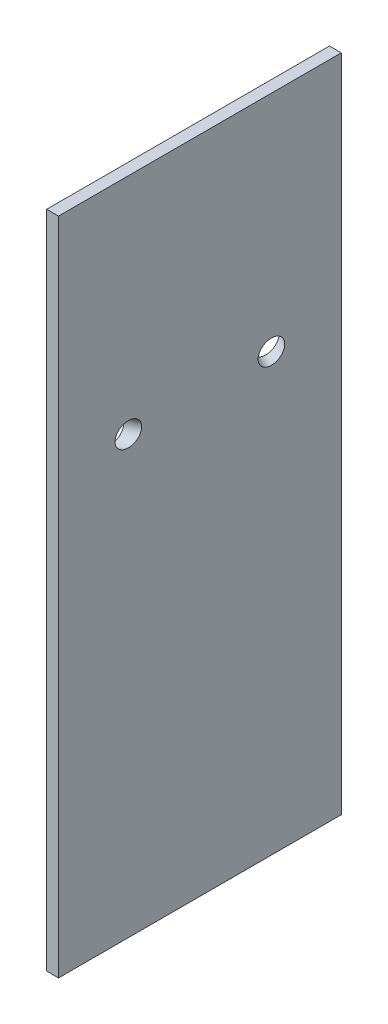
ISO-10303-21;
HEADER;
FILE_DESCRIPTION(('STEP AP214'),'2;1');
FILE_NAME('part.step','',(''),(''),'','','');
FILE_SCHEMA(('AUTOMOTIVE_DESIGN { 1 0 10303 214 1 1 1 1 }'));
ENDSEC;
DATA;
#1=APPLICATION_CONTEXT('core data for automotive mechanical design processes');
#2=APPLICATION_PROTOCOL_DEFINITION('international standard','automotive_design',2000,#1);
#3=PRODUCT_CONTEXT('',#1,'mechanical');
#4=PRODUCT('Part','Part','',(#3));
#5=PRODUCT_RELATED_PRODUCT_CATEGORY('part','',(#4));
#6=PRODUCT_DEFINITION_FORMATION('','',#4);
#7=PRODUCT_DEFINITION_CONTEXT('part definition',#1,'design');
#8=PRODUCT_DEFINITION('design','',#6,#7);
#9=PRODUCT_DEFINITION_SHAPE('','',#8);
#10=(LENGTH_UNIT() NAMED_UNIT(*) SI_UNIT(.MILLI.,.METRE.));
#11=(NAMED_UNIT(*) PLANE_ANGLE_UNIT() SI_UNIT($,.RADIAN.));
#12=(NAMED_UNIT(*) SI_UNIT($,.STERADIAN.) SOLID_ANGLE_UNIT());
#13=UNCERTAINTY_MEASURE_WITH_UNIT(LENGTH_MEASURE(1.E-05),#10,'distance_accuracy_value','');
#14=(GEOMETRIC_REPRESENTATION_CONTEXT(3) GLOBAL_UNCERTAINTY_ASSIGNED_CONTEXT((#13)) GLOBAL_UNIT_ASSIGNED_CONTEXT((#10,
#11,#12)) REPRESENTATION_CONTEXT('',''));
#15=CARTESIAN_POINT('',(0.,0.,0.));
#16=DIRECTION('',(0.,0.,1.));
#17=DIRECTION('',(1.,0.,0.));
#18=AXIS2_PLACEMENT_3D('',#15,#16,#17);
#19=CARTESIAN_POINT('',(6.35,355.6,-152.4));
#20=DIRECTION('',(0.,0.,1.));
#21=DIRECTION('',(0.,-1.,0.));
#22=AXIS2_PLACEMENT_3D('',#19,#20,#21);
#23=PLANE('',#22);
#24=DIRECTION('',(0.,1.,0.));
#25=VECTOR('',#24,1.);
#26=CARTESIAN_POINT('',(-6.35,355.6,-152.4));
#27=LINE('',#26,#25);
#28=CARTESIAN_POINT('',(-6.35,-355.6,-152.4));
#29=VERTEX_POINT('',#28);
#30=CARTESIAN_POINT('',(-6.35,355.6,-152.4));
#31=VERTEX_POINT('',#30);
#32=EDGE_CURVE('E115',#29,#31,#27,.T.);
#33=ORIENTED_EDGE('',*,*,#32,.T.);
#34=DIRECTION('',(-1.,0.,0.));
#35=VECTOR('',#34,1.);
#36=CARTESIAN_POINT('',(6.35,355.6,-152.4));
#37=LINE('',#36,#35);
#38=CARTESIAN_POINT('',(6.35,355.6,-152.4));
#39=VERTEX_POINT('',#38);
#40=EDGE_CURVE('E102',#39,#31,#37,.T.);
#41=ORIENTED_EDGE('',*,*,#40,.F.);
#42=DIRECTION('',(0.,1.,0.));
#43=VECTOR('',#42,1.);
#44=CARTESIAN_POINT('',(6.35,355.6,-152.4));
#45=LINE('',#44,#43);
#46=CARTESIAN_POINT('',(6.35,-355.6,-152.4));
#47=VERTEX_POINT('',#46);
#48=EDGE_CURVE('E121',#47,#39,#45,.T.);
#49=ORIENTED_EDGE('',*,*,#48,.F.);
#50=DIRECTION('',(-1.,0.,0.));
#51=VECTOR('',#50,1.);
#52=CARTESIAN_POINT('',(6.35,-355.6,-152.4));
#53=LINE('',#52,#51);
#54=EDGE_CURVE('E104',#47,#29,#53,.T.);
#55=ORIENTED_EDGE('',*,*,#54,.T.);
#56=EDGE_LOOP('',(#33,#41,#49,#55));
#57=FACE_BOUND('',#56,.T.);
#58=ADVANCED_FACE('F46',(#57),#23,.F.);
#59=CARTESIAN_POINT('',(6.35,355.6,152.4));
#60=DIRECTION('',(0.,-1.,0.));
#61=DIRECTION('',(0.,0.,-1.));
#62=AXIS2_PLACEMENT_3D('',#59,#60,#61);
#63=PLANE('',#62);
#64=DIRECTION('',(0.,0.,1.));
#65=VECTOR('',#64,1.);
#66=CARTESIAN_POINT('',(-6.35,355.6,152.4));
#67=LINE('',#66,#65);
#68=CARTESIAN_POINT('',(-6.35,355.6,152.4));
#69=VERTEX_POINT('',#68);
#70=EDGE_CURVE('E65',#31,#69,#67,.T.);
#71=ORIENTED_EDGE('',*,*,#70,.T.);
#72=DIRECTION('',(-1.,0.,0.));
#73=VECTOR('',#72,1.);
#74=CARTESIAN_POINT('',(6.35,355.6,152.4));
#75=LINE('',#74,#73);
#76=CARTESIAN_POINT('',(6.35,355.6,152.4));
#77=VERTEX_POINT('',#76);
#78=EDGE_CURVE('E99',#77,#69,#75,.T.);
#79=ORIENTED_EDGE('',*,*,#78,.F.);
#80=DIRECTION('',(0.,0.,1.));
#81=VECTOR('',#80,1.);
#82=CARTESIAN_POINT('',(6.35,355.6,152.4));
#83=LINE('',#82,#81);
#84=EDGE_CURVE('E81',#39,#77,#83,.T.);
#85=ORIENTED_EDGE('',*,*,#84,.F.);
#86=ORIENTED_EDGE('',*,*,#40,.T.);
#87=EDGE_LOOP('',(#71,#79,#85,#86));
#88=FACE_BOUND('',#87,.T.);
#89=ADVANCED_FACE('F98',(#88),#63,.F.);
#90=CARTESIAN_POINT('',(6.35,355.6,152.4));
#91=DIRECTION('',(0.,0.,-1.));
#92=DIRECTION('',(0.,1.,0.));
#93=AXIS2_PLACEMENT_3D('',#90,#91,#92);
#94=PLANE('',#93);
#95=DIRECTION('',(0.,-1.,0.));
#96=VECTOR('',#95,1.);
#97=CARTESIAN_POINT('',(-6.35,355.6,152.4));
#98=LINE('',#97,#96);
#99=CARTESIAN_POINT('',(-6.35,-355.6,152.4));
#100=VERTEX_POINT('',#99);
#101=EDGE_CURVE('E96',#69,#100,#98,.T.);
#102=ORIENTED_EDGE('',*,*,#101,.T.);
#103=DIRECTION('',(-1.,0.,0.));
#104=VECTOR('',#103,1.);
#105=CARTESIAN_POINT('',(6.35,-355.6,152.4));
#106=LINE('',#105,#104);
#107=CARTESIAN_POINT('',(6.35,-355.6,152.4));
#108=VERTEX_POINT('',#107);
#109=EDGE_CURVE('E124',#108,#100,#106,.T.);
#110=ORIENTED_EDGE('',*,*,#109,.F.);
#111=DIRECTION('',(0.,-1.,0.));
#112=VECTOR('',#111,1.);
#113=CARTESIAN_POINT('',(6.35,355.6,152.4));
#114=LINE('',#113,#112);
#115=EDGE_CURVE('E107',#77,#108,#114,.T.);
#116=ORIENTED_EDGE('',*,*,#115,.F.);
#117=ORIENTED_EDGE('',*,*,#78,.T.);
#118=EDGE_LOOP('',(#102,#110,#116,#117));
#119=FACE_BOUND('',#118,.T.);
#120=ADVANCED_FACE('F106',(#119),#94,.F.);
#121=CARTESIAN_POINT('',(6.35,-355.6,152.4));
#122=DIRECTION('',(0.,1.,0.));
#123=DIRECTION('',(0.,0.,1.));
#124=AXIS2_PLACEMENT_3D('',#121,#122,#123);
#125=PLANE('',#124);
#126=DIRECTION('',(0.,0.,-1.));
#127=VECTOR('',#126,1.);
#128=CARTESIAN_POINT('',(-6.35,-355.6,152.4));
#129=LINE('',#128,#127);
#130=EDGE_CURVE('E90',#100,#29,#129,.T.);
#131=ORIENTED_EDGE('',*,*,#130,.T.);
#132=ORIENTED_EDGE('',*,*,#54,.F.);
#133=DIRECTION('',(0.,0.,-1.));
#134=VECTOR('',#133,1.);
#135=CARTESIAN_POINT('',(6.35,-355.6,152.4));
#136=LINE('',#135,#134);
#137=EDGE_CURVE('E117',#108,#47,#136,.T.);
#138=ORIENTED_EDGE('',*,*,#137,.F.);
#139=ORIENTED_EDGE('',*,*,#109,.T.);
#140=EDGE_LOOP('',(#131,#132,#138,#139));
#141=FACE_BOUND('',#140,.T.);
#142=ADVANCED_FACE('F132',(#141),#125,.F.);
#143=CARTESIAN_POINT('',(6.35,0.,0.));
#144=DIRECTION('',(1.,0.,0.));
#145=DIRECTION('',(0.,0.,-1.));
#146=AXIS2_PLACEMENT_3D('',#143,#144,#145);
#147=PLANE('',#146);
#148=CARTESIAN_POINT('',(6.34999999999997,114.3,77.0805555555679));
#149=DIRECTION('',(1.,0.,0.));
#150=DIRECTION('',(0.,0.,1.));
#151=AXIS2_PLACEMENT_3D('',#148,#149,#150);
#152=ELLIPSE('',#151,14.360265663917,12.7);
#153=CARTESIAN_POINT('',(6.34999999999997,114.3,91.4408212194849));
#154=VERTEX_POINT('',#153);
#155=EDGE_CURVE('E122',#154,#154,#152,.F.);
#156=ORIENTED_EDGE('',*,*,#155,.T.);
#157=EDGE_LOOP('',(#156));
#158=FACE_BOUND('',#157,.T.);
#159=CARTESIAN_POINT('',(6.34999999999997,114.3,-77.0805555555697));
#160=DIRECTION('',(1.,0.,0.));
#161=DIRECTION('',(0.,0.,1.));
#162=AXIS2_PLACEMENT_3D('',#159,#160,#161);
#163=ELLIPSE('',#162,14.3602656639171,12.7);
#164=CARTESIAN_POINT('',(6.34999999999997,114.3,-62.7202898916527));
#165=VERTEX_POINT('',#164);
#166=EDGE_CURVE('E50',#165,#165,#163,.F.);
#167=ORIENTED_EDGE('',*,*,#166,.T.);
#168=EDGE_LOOP('',(#167));
#169=FACE_BOUND('',#168,.T.);
#170=ORIENTED_EDGE('',*,*,#48,.T.);
#171=ORIENTED_EDGE('',*,*,#84,.T.);
#172=ORIENTED_EDGE('',*,*,#115,.T.);
#173=ORIENTED_EDGE('',*,*,#137,.T.);
#174=EDGE_LOOP('',(#170,#171,#172,#173));
#175=FACE_BOUND('',#174,.T.);
#176=ADVANCED_FACE('F48',(#158,#169,#175),#147,.T.);
#177=CARTESIAN_POINT('',(-6.35,0.,0.));
#178=DIRECTION('',(1.,0.,0.));
#179=DIRECTION('',(0.,0.,-1.));
#180=AXIS2_PLACEMENT_3D('',#177,#178,#179);
#181=PLANE('',#180);
#182=CARTESIAN_POINT('',(-6.34999999999997,114.3,83.7833333333458));
#183=DIRECTION('',(1.,0.,0.));
#184=DIRECTION('',(0.,0.,1.));
#185=AXIS2_PLACEMENT_3D('',#182,#183,#184);
#186=ELLIPSE('',#185,14.360265663917,12.7);
#187=CARTESIAN_POINT('',(-6.34999999999997,114.3,98.1435989972629));
#188=VERTEX_POINT('',#187);
#189=EDGE_CURVE('E11',#188,#188,#186,.F.);
#190=ORIENTED_EDGE('',*,*,#189,.F.);
#191=EDGE_LOOP('',(#190));
#192=FACE_BOUND('',#191,.T.);
#193=CARTESIAN_POINT('',(-6.34999999999999,114.3,-83.7833333333478));
#194=DIRECTION('',(1.,0.,0.));
#195=DIRECTION('',(0.,0.,1.));
#196=AXIS2_PLACEMENT_3D('',#193,#194,#195);
#197=ELLIPSE('',#196,14.3602656639171,12.7);
#198=CARTESIAN_POINT('',(-6.34999999999999,114.3,-69.4230676694307));
#199=VERTEX_POINT('',#198);
#200=EDGE_CURVE('E56',#199,#199,#197,.F.);
#201=ORIENTED_EDGE('',*,*,#200,.F.);
#202=EDGE_LOOP('',(#201));
#203=FACE_BOUND('',#202,.T.);
#204=ORIENTED_EDGE('',*,*,#32,.F.);
#205=ORIENTED_EDGE('',*,*,#130,.F.);
#206=ORIENTED_EDGE('',*,*,#101,.F.);
#207=ORIENTED_EDGE('',*,*,#70,.F.);
#208=EDGE_LOOP('',(#204,#205,#206,#207));
#209=FACE_BOUND('',#208,.T.);
#210=ADVANCED_FACE('F109',(#192,#203,#209),#181,.F.);
#211=CARTESIAN_POINT('',(-226.549999999963,114.300000000001,-200.));
#212=DIRECTION('',(0.884384752846962,0.,0.466758619558138));
#213=DIRECTION('',(0.466758619558138,0.,-0.884384752846962));
#214=AXIS2_PLACEMENT_3D('',#211,#212,#213);
#215=CYLINDRICAL_SURFACE('',#214,12.7);
#216=ORIENTED_EDGE('',*,*,#166,.F.);
#217=EDGE_LOOP('',(#216));
#218=FACE_BOUND('',#217,.T.);
#219=ORIENTED_EDGE('',*,*,#200,.T.);
#220=EDGE_LOOP('',(#219));
#221=FACE_BOUND('',#220,.T.);
#222=ADVANCED_FACE('F138',(#218,#221),#215,.F.);
#223=CARTESIAN_POINT('',(673.45,114.299999999997,-275.));
#224=DIRECTION('',(-0.884384752846963,0.,0.466758619558136));
#225=DIRECTION('',(0.466758619558136,0.,0.884384752846963));
#226=AXIS2_PLACEMENT_3D('',#223,#224,#225);
#227=CYLINDRICAL_SURFACE('',#226,12.7);
#228=ORIENTED_EDGE('',*,*,#155,.F.);
#229=EDGE_LOOP('',(#228));
#230=FACE_BOUND('',#229,.T.);
#231=ORIENTED_EDGE('',*,*,#189,.T.);
#232=EDGE_LOOP('',(#231));
#233=FACE_BOUND('',#232,.T.);
#234=ADVANCED_FACE('F151',(#230,#233),#227,.F.);
#235=CLOSED_SHELL('',(#58,#89,#120,#142,#176,#210,#222,#234));
#236=MANIFOLD_SOLID_BREP('B2',#235);
#237=ADVANCED_BREP_SHAPE_REPRESENTATION('',(#18,#236),#14);
#238=SHAPE_DEFINITION_REPRESENTATION(#9,#237);
ENDSEC;
END-ISO-10303-21;
